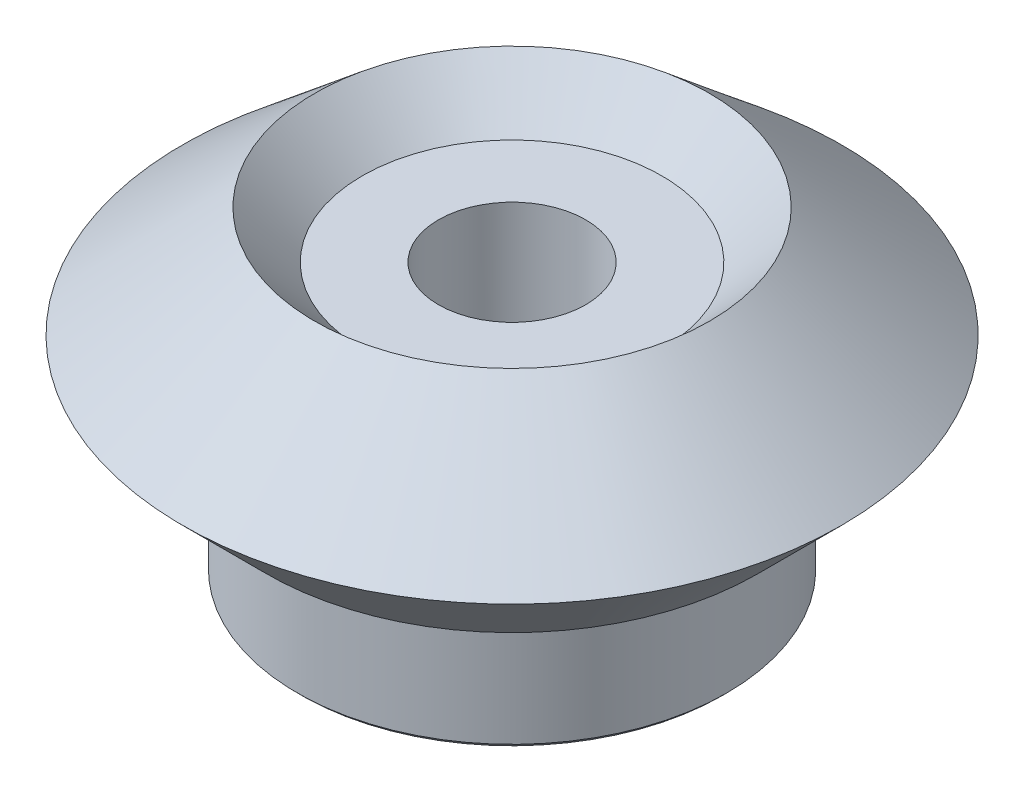
ISO-10303-21;
HEADER;
FILE_DESCRIPTION(('STEP AP214'),'2;1');
FILE_NAME('part.step','',(''),(''),'','','');
FILE_SCHEMA(('AUTOMOTIVE_DESIGN { 1 0 10303 214 1 1 1 1 }'));
ENDSEC;
DATA;
#1=APPLICATION_CONTEXT('core data for automotive mechanical design processes');
#2=APPLICATION_PROTOCOL_DEFINITION('international standard','automotive_design',2000,#1);
#3=PRODUCT_CONTEXT('',#1,'mechanical');
#4=PRODUCT('Part','Part','',(#3));
#5=PRODUCT_RELATED_PRODUCT_CATEGORY('part','',(#4));
#6=PRODUCT_DEFINITION_FORMATION('','',#4);
#7=PRODUCT_DEFINITION_CONTEXT('part definition',#1,'design');
#8=PRODUCT_DEFINITION('design','',#6,#7);
#9=PRODUCT_DEFINITION_SHAPE('','',#8);
#10=(LENGTH_UNIT() NAMED_UNIT(*) SI_UNIT(.MILLI.,.METRE.));
#11=(NAMED_UNIT(*) PLANE_ANGLE_UNIT() SI_UNIT($,.RADIAN.));
#12=(NAMED_UNIT(*) SI_UNIT($,.STERADIAN.) SOLID_ANGLE_UNIT());
#13=UNCERTAINTY_MEASURE_WITH_UNIT(LENGTH_MEASURE(1.E-05),#10,'distance_accuracy_value','');
#14=(GEOMETRIC_REPRESENTATION_CONTEXT(3) GLOBAL_UNCERTAINTY_ASSIGNED_CONTEXT((#13)) GLOBAL_UNIT_ASSIGNED_CONTEXT((#10,
#11,#12)) REPRESENTATION_CONTEXT('',''));
#15=CARTESIAN_POINT('',(0.,0.,0.));
#16=DIRECTION('',(0.,0.,1.));
#17=DIRECTION('',(1.,0.,0.));
#18=AXIS2_PLACEMENT_3D('',#15,#16,#17);
#19=CARTESIAN_POINT('',(5.35355339056397,2.93005531670405E-11,40.));
#20=DIRECTION('',(0.,-1.,0.));
#21=DIRECTION('',(1.,0.,0.));
#22=AXIS2_PLACEMENT_3D('',#19,#20,#21);
#23=PLANE('',#22);
#24=CARTESIAN_POINT('',(0.,0.,40.));
#25=DIRECTION('',(0.,-1.,0.));
#26=DIRECTION('',(1.,0.,0.));
#27=AXIS2_PLACEMENT_3D('',#24,#25,#26);
#28=CIRCLE('',#27,6.);
#29=CARTESIAN_POINT('',(6.,0.,40.));
#30=VERTEX_POINT('',#29);
#31=EDGE_CURVE('E72',#30,#30,#28,.T.);
#32=ORIENTED_EDGE('',*,*,#31,.F.);
#33=EDGE_LOOP('',(#32));
#34=FACE_BOUND('',#33,.T.);
#35=CARTESIAN_POINT('',(0.,2.92994795092483E-11,40.));
#36=DIRECTION('',(0.,-1.,0.));
#37=DIRECTION('',(1.,0.,0.));
#38=AXIS2_PLACEMENT_3D('',#35,#36,#37);
#39=CIRCLE('',#38,17.1464466094363);
#40=CARTESIAN_POINT('',(17.1464466094363,2.92989048503715E-11,40.));
#41=VERTEX_POINT('',#40);
#42=EDGE_CURVE('E10',#41,#41,#39,.T.);
#43=ORIENTED_EDGE('',*,*,#42,.T.);
#44=EDGE_LOOP('',(#43));
#45=FACE_BOUND('',#44,.T.);
#46=ADVANCED_FACE('F37',(#34,#45),#23,.T.);
#47=CARTESIAN_POINT('',(0.,2.92994795092483E-11,40.));
#48=DIRECTION('',(0.,1.,0.));
#49=DIRECTION('',(-1.,0.,0.));
#50=AXIS2_PLACEMENT_3D('',#47,#48,#49);
#51=CONICAL_SURFACE('',#50,17.1464466094363,0.785398163397448);
#52=CARTESIAN_POINT('',(0.,0.353553390622437,40.));
#53=DIRECTION('',(0.,-1.,0.));
#54=DIRECTION('',(1.,0.,0.));
#55=AXIS2_PLACEMENT_3D('',#52,#53,#54);
#56=CIRCLE('',#55,17.5000000000294);
#57=CARTESIAN_POINT('',(17.5000000000294,0.353553390622436,40.));
#58=VERTEX_POINT('',#57);
#59=EDGE_CURVE('E45',#58,#58,#56,.T.);
#60=ORIENTED_EDGE('',*,*,#59,.T.);
#61=EDGE_LOOP('',(#60));
#62=FACE_BOUND('',#61,.T.);
#63=ORIENTED_EDGE('',*,*,#42,.F.);
#64=EDGE_LOOP('',(#63));
#65=FACE_BOUND('',#64,.T.);
#66=ADVANCED_FACE('F116',(#62,#65),#51,.T.);
#67=CARTESIAN_POINT('',(0.,25.88,40.));
#68=DIRECTION('',(0.,-1.,0.));
#69=DIRECTION('',(1.,0.,0.));
#70=AXIS2_PLACEMENT_3D('',#67,#68,#69);
#71=CYLINDRICAL_SURFACE('',#70,17.5000000000294);
#72=CARTESIAN_POINT('',(0.,10.,40.));
#73=DIRECTION('',(0.,-1.,0.));
#74=DIRECTION('',(1.,0.,0.));
#75=AXIS2_PLACEMENT_3D('',#72,#73,#74);
#76=CIRCLE('',#75,17.5000000000294);
#77=CARTESIAN_POINT('',(17.5000000000294,10.,40.));
#78=VERTEX_POINT('',#77);
#79=EDGE_CURVE('E50',#78,#78,#76,.T.);
#80=ORIENTED_EDGE('',*,*,#79,.T.);
#81=EDGE_LOOP('',(#80));
#82=FACE_BOUND('',#81,.T.);
#83=ORIENTED_EDGE('',*,*,#59,.F.);
#84=EDGE_LOOP('',(#83));
#85=FACE_BOUND('',#84,.T.);
#86=ADVANCED_FACE('F110',(#82,#85),#71,.T.);
#87=CARTESIAN_POINT('',(17.5000000000294,10.,40.));
#88=DIRECTION('',(0.,-1.,0.));
#89=DIRECTION('',(1.,0.,0.));
#90=AXIS2_PLACEMENT_3D('',#87,#88,#89);
#91=PLANE('',#90);
#92=CARTESIAN_POINT('',(0.,10.,40.));
#93=DIRECTION('',(0.,-1.,0.));
#94=DIRECTION('',(1.,0.,0.));
#95=AXIS2_PLACEMENT_3D('',#92,#93,#94);
#96=CIRCLE('',#95,19.995);
#97=CARTESIAN_POINT('',(19.995,10.,40.));
#98=VERTEX_POINT('',#97);
#99=EDGE_CURVE('E56',#98,#98,#96,.T.);
#100=ORIENTED_EDGE('',*,*,#99,.T.);
#101=EDGE_LOOP('',(#100));
#102=FACE_BOUND('',#101,.T.);
#103=ORIENTED_EDGE('',*,*,#79,.F.);
#104=EDGE_LOOP('',(#103));
#105=FACE_BOUND('',#104,.T.);
#106=ADVANCED_FACE('F104',(#102,#105),#91,.T.);
#107=CARTESIAN_POINT('',(0.,10.,40.));
#108=DIRECTION('',(0.,1.,0.));
#109=DIRECTION('',(-1.,0.,0.));
#110=AXIS2_PLACEMENT_3D('',#107,#108,#109);
#111=CONICAL_SURFACE('',#110,19.995,0.785398163397447);
#112=CARTESIAN_POINT('',(0.,16.86,40.));
#113=DIRECTION('',(0.,-1.,0.));
#114=DIRECTION('',(1.,0.,0.));
#115=AXIS2_PLACEMENT_3D('',#112,#113,#114);
#116=CIRCLE('',#115,26.855);
#117=CARTESIAN_POINT('',(26.855,16.86,40.));
#118=VERTEX_POINT('',#117);
#119=EDGE_CURVE('E60',#118,#118,#116,.T.);
#120=ORIENTED_EDGE('',*,*,#119,.T.);
#121=EDGE_LOOP('',(#120));
#122=FACE_BOUND('',#121,.T.);
#123=ORIENTED_EDGE('',*,*,#99,.F.);
#124=EDGE_LOOP('',(#123));
#125=FACE_BOUND('',#124,.T.);
#126=ADVANCED_FACE('F98',(#122,#125),#111,.T.);
#127=CARTESIAN_POINT('',(0.,16.86,40.));
#128=DIRECTION('',(0.,-1.,0.));
#129=DIRECTION('',(1.,0.,0.));
#130=AXIS2_PLACEMENT_3D('',#127,#128,#129);
#131=CONICAL_SURFACE('',#130,26.855,0.873572197208198);
#132=CARTESIAN_POINT('',(0.,25.88,40.));
#133=DIRECTION('',(0.,-1.,0.));
#134=DIRECTION('',(1.,0.,0.));
#135=AXIS2_PLACEMENT_3D('',#132,#133,#134);
#136=CIRCLE('',#135,16.08554804432);
#137=CARTESIAN_POINT('',(16.08554804432,25.88,40.));
#138=VERTEX_POINT('',#137);
#139=EDGE_CURVE('E64',#138,#138,#136,.T.);
#140=ORIENTED_EDGE('',*,*,#139,.T.);
#141=EDGE_LOOP('',(#140));
#142=FACE_BOUND('',#141,.T.);
#143=ORIENTED_EDGE('',*,*,#119,.F.);
#144=EDGE_LOOP('',(#143));
#145=FACE_BOUND('',#144,.T.);
#146=ADVANCED_FACE('F92',(#142,#145),#131,.T.);
#147=CARTESIAN_POINT('',(0.,25.88,40.));
#148=DIRECTION('',(0.,1.,0.));
#149=DIRECTION('',(-1.,0.,0.));
#150=AXIS2_PLACEMENT_3D('',#147,#148,#149);
#151=CONICAL_SURFACE('',#150,16.08554804432,0.785398163397449);
#152=CARTESIAN_POINT('',(0.,22.,40.));
#153=DIRECTION('',(0.,-1.,0.));
#154=DIRECTION('',(1.,0.,0.));
#155=AXIS2_PLACEMENT_3D('',#152,#153,#154);
#156=CIRCLE('',#155,12.20554804432);
#157=CARTESIAN_POINT('',(12.20554804432,22.,40.));
#158=VERTEX_POINT('',#157);
#159=EDGE_CURVE('E68',#158,#158,#156,.T.);
#160=ORIENTED_EDGE('',*,*,#159,.T.);
#161=EDGE_LOOP('',(#160));
#162=FACE_BOUND('',#161,.T.);
#163=ORIENTED_EDGE('',*,*,#139,.F.);
#164=EDGE_LOOP('',(#163));
#165=FACE_BOUND('',#164,.T.);
#166=ADVANCED_FACE('F86',(#162,#165),#151,.F.);
#167=CARTESIAN_POINT('',(12.20554804432,22.,40.));
#168=DIRECTION('',(0.,1.,0.));
#169=DIRECTION('',(-1.,0.,0.));
#170=AXIS2_PLACEMENT_3D('',#167,#168,#169);
#171=PLANE('',#170);
#172=CARTESIAN_POINT('',(0.,22.,40.));
#173=DIRECTION('',(0.,1.,0.));
#174=DIRECTION('',(-1.,0.,0.));
#175=AXIS2_PLACEMENT_3D('',#172,#173,#174);
#176=CIRCLE('',#175,6.);
#177=CARTESIAN_POINT('',(-6.,22.,40.));
#178=VERTEX_POINT('',#177);
#179=EDGE_CURVE('E40',#178,#178,#176,.T.);
#180=ORIENTED_EDGE('',*,*,#179,.F.);
#181=EDGE_LOOP('',(#180));
#182=FACE_BOUND('',#181,.T.);
#183=ORIENTED_EDGE('',*,*,#159,.F.);
#184=EDGE_LOOP('',(#183));
#185=FACE_BOUND('',#184,.T.);
#186=ADVANCED_FACE('F83',(#182,#185),#171,.T.);
#187=CARTESIAN_POINT('',(0.,25.88,40.));
#188=DIRECTION('',(0.,-1.,0.));
#189=DIRECTION('',(1.,0.,0.));
#190=AXIS2_PLACEMENT_3D('',#187,#188,#189);
#191=CYLINDRICAL_SURFACE('',#190,6.);
#192=ORIENTED_EDGE('',*,*,#179,.T.);
#193=EDGE_LOOP('',(#192));
#194=FACE_BOUND('',#193,.T.);
#195=ORIENTED_EDGE('',*,*,#31,.T.);
#196=EDGE_LOOP('',(#195));
#197=FACE_BOUND('',#196,.T.);
#198=ADVANCED_FACE('F81',(#194,#197),#191,.F.);
#199=CLOSED_SHELL('',(#46,#66,#86,#106,#126,#146,#166,#186,#198));
#200=MANIFOLD_SOLID_BREP('B2',#199);
#201=ADVANCED_BREP_SHAPE_REPRESENTATION('',(#18,#200),#14);
#202=SHAPE_DEFINITION_REPRESENTATION(#9,#201);
ENDSEC;
END-ISO-10303-21;
